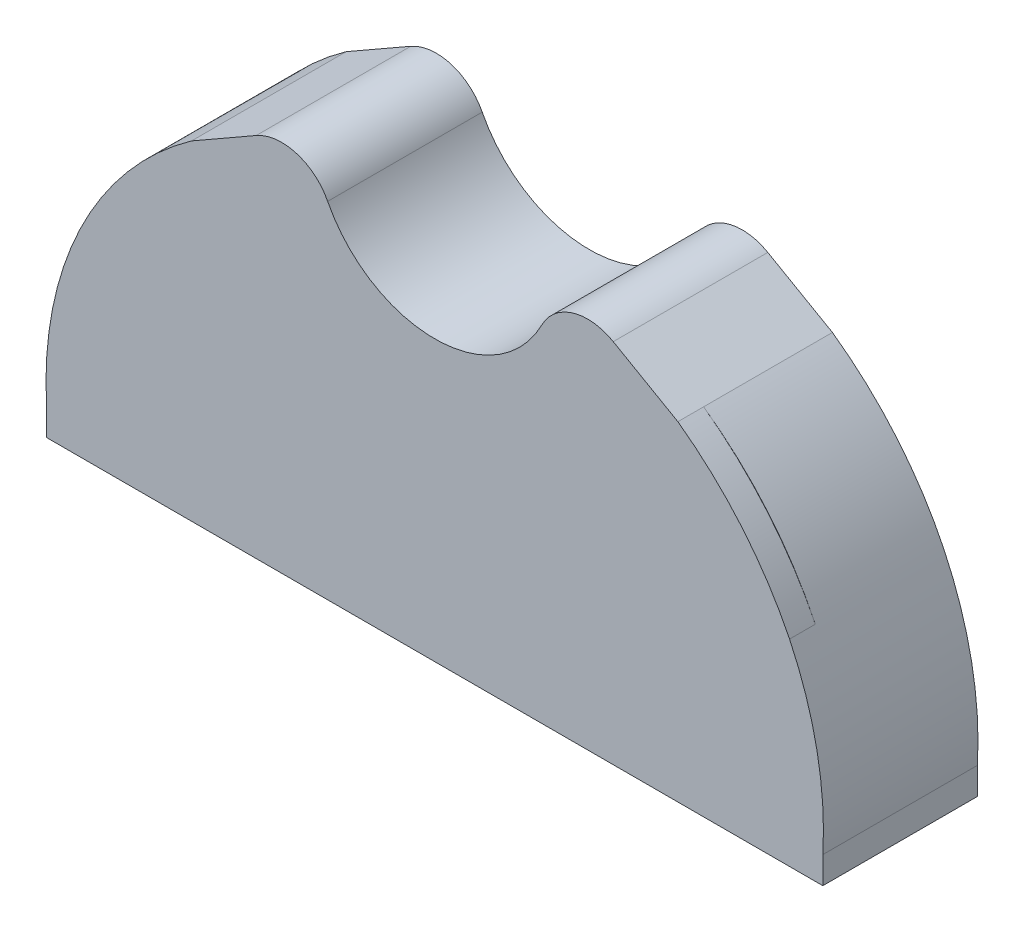
ISO-10303-21;
HEADER;
FILE_DESCRIPTION(('STEP AP214'),'2;1');
FILE_NAME('part.step','',(''),(''),'','','');
FILE_SCHEMA(('AUTOMOTIVE_DESIGN { 1 0 10303 214 1 1 1 1 }'));
ENDSEC;
DATA;
#1=APPLICATION_CONTEXT('core data for automotive mechanical design processes');
#2=APPLICATION_PROTOCOL_DEFINITION('international standard','automotive_design',2000,#1);
#3=PRODUCT_CONTEXT('',#1,'mechanical');
#4=PRODUCT('Part','Part','',(#3));
#5=PRODUCT_RELATED_PRODUCT_CATEGORY('part','',(#4));
#6=PRODUCT_DEFINITION_FORMATION('','',#4);
#7=PRODUCT_DEFINITION_CONTEXT('part definition',#1,'design');
#8=PRODUCT_DEFINITION('design','',#6,#7);
#9=PRODUCT_DEFINITION_SHAPE('','',#8);
#10=(LENGTH_UNIT() NAMED_UNIT(*) SI_UNIT(.MILLI.,.METRE.));
#11=(NAMED_UNIT(*) PLANE_ANGLE_UNIT() SI_UNIT($,.RADIAN.));
#12=(NAMED_UNIT(*) SI_UNIT($,.STERADIAN.) SOLID_ANGLE_UNIT());
#13=UNCERTAINTY_MEASURE_WITH_UNIT(LENGTH_MEASURE(1.E-05),#10,'distance_accuracy_value','');
#14=(GEOMETRIC_REPRESENTATION_CONTEXT(3) GLOBAL_UNCERTAINTY_ASSIGNED_CONTEXT((#13)) GLOBAL_UNIT_ASSIGNED_CONTEXT((#10,
#11,#12)) REPRESENTATION_CONTEXT('',''));
#15=CARTESIAN_POINT('',(0.,0.,0.));
#16=DIRECTION('',(0.,0.,1.));
#17=DIRECTION('',(1.,0.,0.));
#18=AXIS2_PLACEMENT_3D('',#15,#16,#17);
#19=CARTESIAN_POINT('',(27.7778489097587,5.09973857836434,-2.83493096218086));
#20=DIRECTION('',(0.,0.,-1.));
#21=DIRECTION('',(-1.,0.,0.));
#22=AXIS2_PLACEMENT_3D('',#19,#20,#21);
#23=PLANE('',#22);
#24=DIRECTION('',(-0.867919032677829,-0.496705700305101,0.));
#25=VECTOR('',#24,1.);
#26=CARTESIAN_POINT('',(-3.35591314571966,5.86395704618391,-2.83493096218086));
#27=LINE('',#26,#25);
#28=CARTESIAN_POINT('',(12.5796842966775,14.9838193713418,-2.83493096218086));
#29=VERTEX_POINT('',#28);
#30=CARTESIAN_POINT('',(10.6982631754413,13.9070915195408,-2.83493096218086));
#31=VERTEX_POINT('',#30);
#32=EDGE_CURVE('E258',#29,#31,#27,.T.);
#33=ORIENTED_EDGE('',*,*,#32,.F.);
#34=CARTESIAN_POINT('',(13.3247428471351,13.6819408223251,-2.83493096218086));
#35=DIRECTION('',(0.,0.,-1.));
#36=DIRECTION('',(-1.,0.,0.));
#37=AXIS2_PLACEMENT_3D('',#34,#35,#36);
#38=CIRCLE('',#37,1.5);
#39=CARTESIAN_POINT('',(14.6606746659222,14.3640597089954,-2.83493096218086));
#40=VERTEX_POINT('',#39);
#41=EDGE_CURVE('E47',#29,#40,#38,.T.);
#42=ORIENTED_EDGE('',*,*,#41,.T.);
#43=CARTESIAN_POINT('',(17.7778489097587,15.9556704445593,-2.83493096218086));
#44=DIRECTION('',(0.,0.,-1.));
#45=DIRECTION('',(-1.,0.,0.));
#46=AXIS2_PLACEMENT_3D('',#43,#44,#45);
#47=CIRCLE('',#46,3.5);
#48=CARTESIAN_POINT('',(20.8950231535951,14.3640597089954,-2.83493096218086));
#49=VERTEX_POINT('',#48);
#50=EDGE_CURVE('E257',#40,#49,#47,.F.);
#51=ORIENTED_EDGE('',*,*,#50,.T.);
#52=CARTESIAN_POINT('',(22.2309549723822,13.6819408223251,-2.83493096218086));
#53=DIRECTION('',(0.,0.,-1.));
#54=DIRECTION('',(-1.,0.,0.));
#55=AXIS2_PLACEMENT_3D('',#52,#53,#54);
#56=CIRCLE('',#55,1.5);
#57=CARTESIAN_POINT('',(22.9760135228399,14.9838193713418,-2.83493096218086));
#58=VERTEX_POINT('',#57);
#59=EDGE_CURVE('E62',#49,#58,#56,.T.);
#60=ORIENTED_EDGE('',*,*,#59,.T.);
#61=DIRECTION('',(0.86791903267783,-0.4967057003051,0.));
#62=VECTOR('',#61,1.);
#63=CARTESIAN_POINT('',(12.1280923411478,21.1920301427802,-2.83493096218086));
#64=LINE('',#63,#62);
#65=CARTESIAN_POINT('',(24.8574346440761,13.9070915195408,-2.83493096218086));
#66=VERTEX_POINT('',#65);
#67=EDGE_CURVE('E263',#58,#66,#64,.T.);
#68=ORIENTED_EDGE('',*,*,#67,.T.);
#69=CARTESIAN_POINT('',(19.046245228159,5.70754411908348,-2.83493096218086));
#70=DIRECTION('',(0.,0.,-1.));
#71=DIRECTION('',(-1.,0.,0.));
#72=AXIS2_PLACEMENT_3D('',#69,#70,#71);
#73=CIRCLE('',#72,10.0500000000006);
#74=CARTESIAN_POINT('',(29.0778489097587,5.09973857836434,-2.83493096218086));
#75=VERTEX_POINT('',#74);
#76=EDGE_CURVE('E266',#75,#66,#73,.F.);
#77=ORIENTED_EDGE('',*,*,#76,.F.);
#78=DIRECTION('',(0.,1.,0.));
#79=VECTOR('',#78,1.);
#80=CARTESIAN_POINT('',(29.0778489097587,0.,-2.83493096218086));
#81=LINE('',#80,#79);
#82=CARTESIAN_POINT('',(29.0778489097587,4.31545347676928,-2.83493096218086));
#83=VERTEX_POINT('',#82);
#84=EDGE_CURVE('E187',#83,#75,#81,.T.);
#85=ORIENTED_EDGE('',*,*,#84,.F.);
#86=DIRECTION('',(1.,0.,0.));
#87=VECTOR('',#86,1.);
#88=CARTESIAN_POINT('',(0.,4.31545347676928,-2.83493096218086));
#89=LINE('',#88,#87);
#90=CARTESIAN_POINT('',(27.8278489097587,4.31545347676928,-2.83493096218086));
#91=VERTEX_POINT('',#90);
#92=EDGE_CURVE('E184',#91,#83,#89,.T.);
#93=ORIENTED_EDGE('',*,*,#92,.F.);
#94=DIRECTION('',(0.,-1.,0.));
#95=VECTOR('',#94,1.);
#96=CARTESIAN_POINT('',(27.8278489097587,0.,-2.83493096218086));
#97=LINE('',#96,#95);
#98=CARTESIAN_POINT('',(27.8278489097587,5.09973857836434,-2.83493096218086));
#99=VERTEX_POINT('',#98);
#100=EDGE_CURVE('E273',#99,#91,#97,.T.);
#101=ORIENTED_EDGE('',*,*,#100,.F.);
#102=CARTESIAN_POINT('',(17.7778489097581,5.09973857836405,-2.83493096218086));
#103=DIRECTION('',(0.,0.,-1.));
#104=DIRECTION('',(-1.,0.,0.));
#105=AXIS2_PLACEMENT_3D('',#102,#103,#104);
#106=CIRCLE('',#105,10.0500000000006);
#107=CARTESIAN_POINT('',(24.0742946292179,12.9328268136585,-2.83493096218086));
#108=VERTEX_POINT('',#107);
#109=EDGE_CURVE('E277',#108,#99,#106,.T.);
#110=ORIENTED_EDGE('',*,*,#109,.F.);
#111=CARTESIAN_POINT('',(22.7899450048506,11.3350326960114,-2.83493096218086));
#112=DIRECTION('',(0.,0.,-1.));
#113=DIRECTION('',(-1.,0.,0.));
#114=AXIS2_PLACEMENT_3D('',#111,#112,#113);
#115=CIRCLE('',#114,2.05);
#116=CARTESIAN_POINT('',(20.92180009668,12.1791503430702,-2.83493096218086));
#117=VERTEX_POINT('',#116);
#118=EDGE_CURVE('E281',#117,#108,#115,.T.);
#119=ORIENTED_EDGE('',*,*,#118,.F.);
#120=CARTESIAN_POINT('',(17.7778489097587,13.5997385783643,-2.83493096218086));
#121=DIRECTION('',(0.,0.,-1.));
#122=DIRECTION('',(-1.,0.,0.));
#123=AXIS2_PLACEMENT_3D('',#120,#121,#122);
#124=CIRCLE('',#123,3.45);
#125=CARTESIAN_POINT('',(14.6338977228374,12.1791503430702,-2.83493096218086));
#126=VERTEX_POINT('',#125);
#127=EDGE_CURVE('E285',#126,#117,#124,.F.);
#128=ORIENTED_EDGE('',*,*,#127,.F.);
#129=CARTESIAN_POINT('',(12.7657528146667,11.3350326960114,-2.83493096218086));
#130=DIRECTION('',(0.,0.,-1.));
#131=DIRECTION('',(-1.,0.,0.));
#132=AXIS2_PLACEMENT_3D('',#129,#130,#131);
#133=CIRCLE('',#132,2.05);
#134=CARTESIAN_POINT('',(11.4814031902994,12.9328268136585,-2.83493096218086));
#135=VERTEX_POINT('',#134);
#136=EDGE_CURVE('E289',#135,#126,#133,.T.);
#137=ORIENTED_EDGE('',*,*,#136,.F.);
#138=CARTESIAN_POINT('',(17.7778489097587,5.09973857836434,-2.83493096218086));
#139=DIRECTION('',(0.,0.,-1.));
#140=DIRECTION('',(-1.,0.,0.));
#141=AXIS2_PLACEMENT_3D('',#138,#139,#140);
#142=CIRCLE('',#141,10.05);
#143=CARTESIAN_POINT('',(7.72784890975867,5.09973857836434,-2.83493096218086));
#144=VERTEX_POINT('',#143);
#145=EDGE_CURVE('E293',#144,#135,#142,.T.);
#146=ORIENTED_EDGE('',*,*,#145,.F.);
#147=DIRECTION('',(0.,-1.,0.));
#148=VECTOR('',#147,1.);
#149=CARTESIAN_POINT('',(7.72784890975867,0.,-2.83493096218086));
#150=LINE('',#149,#148);
#151=CARTESIAN_POINT('',(7.72784890975867,4.31545347676928,-2.83493096218086));
#152=VERTEX_POINT('',#151);
#153=EDGE_CURVE('E265',#144,#152,#150,.T.);
#154=ORIENTED_EDGE('',*,*,#153,.T.);
#155=DIRECTION('',(-1.,0.,0.));
#156=VECTOR('',#155,1.);
#157=CARTESIAN_POINT('',(0.,4.31545347676928,-2.83493096218086));
#158=LINE('',#157,#156);
#159=CARTESIAN_POINT('',(6.47784890975867,4.31545347676928,-2.83493096218086));
#160=VERTEX_POINT('',#159);
#161=EDGE_CURVE('E298',#152,#160,#158,.T.);
#162=ORIENTED_EDGE('',*,*,#161,.T.);
#163=DIRECTION('',(0.,1.,0.));
#164=VECTOR('',#163,1.);
#165=CARTESIAN_POINT('',(6.47784890975867,0.,-2.83493096218086));
#166=LINE('',#165,#164);
#167=CARTESIAN_POINT('',(6.47784890975867,5.09973857836434,-2.83493096218086));
#168=VERTEX_POINT('',#167);
#169=EDGE_CURVE('E261',#160,#168,#166,.T.);
#170=ORIENTED_EDGE('',*,*,#169,.T.);
#171=CARTESIAN_POINT('',(16.5094525913577,5.7075441190838,-2.83493096218086));
#172=DIRECTION('',(0.,0.,-1.));
#173=DIRECTION('',(-1.,0.,0.));
#174=AXIS2_PLACEMENT_3D('',#171,#172,#173);
#175=CIRCLE('',#174,10.05);
#176=EDGE_CURVE('E301',#31,#168,#175,.F.);
#177=ORIENTED_EDGE('',*,*,#176,.F.);
#178=EDGE_LOOP('',(#33,#42,#51,#60,#68,#77,#85,#93,#101,#110,#119,#128,#137,#146,#154,#162,#170,#177));
#179=FACE_BOUND('',#178,.T.);
#180=ADVANCED_FACE('F39',(#179),#23,.T.);
#181=CARTESIAN_POINT('',(-3.35591314571966,5.86395704618391,-28.2891846722938));
#182=DIRECTION('',(-0.496705700305101,0.867919032677829,0.));
#183=DIRECTION('',(-0.867919032677829,-0.496705700305101,0.));
#184=AXIS2_PLACEMENT_3D('',#181,#182,#183);
#185=PLANE('',#184);
#186=DIRECTION('',(0.,0.,1.));
#187=VECTOR('',#186,1.);
#188=CARTESIAN_POINT('',(10.6982631754413,13.9070915195408,-28.2891846722938));
#189=LINE('',#188,#187);
#190=CARTESIAN_POINT('',(10.6982631754413,13.9070915195408,1.66506903781914));
#191=VERTEX_POINT('',#190);
#192=EDGE_CURVE('E260',#31,#191,#189,.T.);
#193=ORIENTED_EDGE('',*,*,#192,.T.);
#194=DIRECTION('',(-0.867919032677829,-0.496705700305101,0.));
#195=VECTOR('',#194,1.);
#196=CARTESIAN_POINT('',(-3.35591314571965,5.86395704618391,1.66506903781914));
#197=LINE('',#196,#195);
#198=CARTESIAN_POINT('',(12.5796842966775,14.9838193713418,1.66506903781914));
#199=VERTEX_POINT('',#198);
#200=EDGE_CURVE('E223',#199,#191,#197,.T.);
#201=ORIENTED_EDGE('',*,*,#200,.F.);
#202=DIRECTION('',(0.,0.,-1.));
#203=VECTOR('',#202,1.);
#204=CARTESIAN_POINT('',(12.5796842966775,14.9838193713418,-2.83493096218086));
#205=LINE('',#204,#203);
#206=EDGE_CURVE('E333',#199,#29,#205,.T.);
#207=ORIENTED_EDGE('',*,*,#206,.T.);
#208=ORIENTED_EDGE('',*,*,#32,.T.);
#209=EDGE_LOOP('',(#193,#201,#207,#208));
#210=FACE_BOUND('',#209,.T.);
#211=ADVANCED_FACE('F349',(#210),#185,.T.);
#212=CARTESIAN_POINT('',(16.5094525913577,5.7075441190838,-28.2891846722938));
#213=DIRECTION('',(0.,0.,1.));
#214=DIRECTION('',(1.,0.,0.));
#215=AXIS2_PLACEMENT_3D('',#212,#213,#214);
#216=CYLINDRICAL_SURFACE('',#215,10.05);
#217=ORIENTED_EDGE('',*,*,#192,.F.);
#218=ORIENTED_EDGE('',*,*,#176,.T.);
#219=DIRECTION('',(0.,0.,1.));
#220=VECTOR('',#219,1.);
#221=CARTESIAN_POINT('',(6.47784890975867,5.09973857836434,-28.2891846722938));
#222=LINE('',#221,#220);
#223=CARTESIAN_POINT('',(6.47784890975867,5.09973857836434,1.66506903781914));
#224=VERTEX_POINT('',#223);
#225=EDGE_CURVE('E304',#168,#224,#222,.T.);
#226=ORIENTED_EDGE('',*,*,#225,.T.);
#227=CARTESIAN_POINT('',(16.5094525913577,5.7075441190838,1.66506903781914));
#228=DIRECTION('',(0.,0.,1.));
#229=DIRECTION('',(1.,0.,0.));
#230=AXIS2_PLACEMENT_3D('',#227,#228,#229);
#231=CIRCLE('',#230,10.05);
#232=EDGE_CURVE('E226',#191,#224,#231,.T.);
#233=ORIENTED_EDGE('',*,*,#232,.F.);
#234=EDGE_LOOP('',(#217,#218,#226,#233));
#235=FACE_BOUND('',#234,.T.);
#236=ADVANCED_FACE('F352',(#235),#216,.T.);
#237=CARTESIAN_POINT('',(6.47784890975867,0.,-28.2891846722938));
#238=DIRECTION('',(1.,0.,0.));
#239=DIRECTION('',(0.,0.,-1.));
#240=AXIS2_PLACEMENT_3D('',#237,#238,#239);
#241=PLANE('',#240);
#242=ORIENTED_EDGE('',*,*,#169,.F.);
#243=DIRECTION('',(0.,0.,1.));
#244=VECTOR('',#243,1.);
#245=CARTESIAN_POINT('',(6.47784890975867,4.31545347676928,-28.2891846722938));
#246=LINE('',#245,#244);
#247=CARTESIAN_POINT('',(6.47784890975867,4.31545347676928,1.66506903781914));
#248=VERTEX_POINT('',#247);
#249=EDGE_CURVE('E326',#160,#248,#246,.T.);
#250=ORIENTED_EDGE('',*,*,#249,.T.);
#251=DIRECTION('',(0.,-1.,0.));
#252=VECTOR('',#251,1.);
#253=CARTESIAN_POINT('',(6.47784890975867,0.,1.66506903781914));
#254=LINE('',#253,#252);
#255=EDGE_CURVE('E202',#224,#248,#254,.T.);
#256=ORIENTED_EDGE('',*,*,#255,.F.);
#257=ORIENTED_EDGE('',*,*,#225,.F.);
#258=EDGE_LOOP('',(#242,#250,#256,#257));
#259=FACE_BOUND('',#258,.T.);
#260=ADVANCED_FACE('F356',(#259),#241,.F.);
#261=CARTESIAN_POINT('',(0.,4.31545347676928,-28.2891846722938));
#262=DIRECTION('',(0.,1.,0.));
#263=DIRECTION('',(0.,0.,1.));
#264=AXIS2_PLACEMENT_3D('',#261,#262,#263);
#265=PLANE('',#264);
#266=ORIENTED_EDGE('',*,*,#161,.F.);
#267=DIRECTION('',(0.,0.,1.));
#268=VECTOR('',#267,1.);
#269=CARTESIAN_POINT('',(7.72784890975867,4.31545347676928,-28.2891846722938));
#270=LINE('',#269,#268);
#271=CARTESIAN_POINT('',(7.72784890975867,4.31545347676928,0.915069037819143));
#272=VERTEX_POINT('',#271);
#273=EDGE_CURVE('E323',#152,#272,#270,.T.);
#274=ORIENTED_EDGE('',*,*,#273,.T.);
#275=DIRECTION('',(1.,0.,0.));
#276=VECTOR('',#275,1.);
#277=CARTESIAN_POINT('',(0.,4.31545347676928,0.915069037819143));
#278=LINE('',#277,#276);
#279=CARTESIAN_POINT('',(27.8278489097587,4.31545347676928,0.915069037819143));
#280=VERTEX_POINT('',#279);
#281=EDGE_CURVE('E205',#272,#280,#278,.T.);
#282=ORIENTED_EDGE('',*,*,#281,.T.);
#283=DIRECTION('',(0.,0.,1.));
#284=VECTOR('',#283,1.);
#285=CARTESIAN_POINT('',(27.8278489097587,4.31545347676928,-28.2891846722938));
#286=LINE('',#285,#284);
#287=EDGE_CURVE('E272',#91,#280,#286,.T.);
#288=ORIENTED_EDGE('',*,*,#287,.F.);
#289=ORIENTED_EDGE('',*,*,#92,.T.);
#290=DIRECTION('',(0.,0.,1.));
#291=VECTOR('',#290,1.);
#292=CARTESIAN_POINT('',(29.0778489097587,4.31545347676928,-28.2891846722938));
#293=LINE('',#292,#291);
#294=CARTESIAN_POINT('',(29.0778489097587,4.31545347676928,1.66506903781914));
#295=VERTEX_POINT('',#294);
#296=EDGE_CURVE('E176',#83,#295,#293,.T.);
#297=ORIENTED_EDGE('',*,*,#296,.T.);
#298=DIRECTION('',(1.,0.,0.));
#299=VECTOR('',#298,1.);
#300=CARTESIAN_POINT('',(0.,4.31545347676928,1.66506903781914));
#301=LINE('',#300,#299);
#302=EDGE_CURVE('E182',#248,#295,#301,.T.);
#303=ORIENTED_EDGE('',*,*,#302,.F.);
#304=ORIENTED_EDGE('',*,*,#249,.F.);
#305=EDGE_LOOP('',(#266,#274,#282,#288,#289,#297,#303,#304));
#306=FACE_BOUND('',#305,.T.);
#307=ADVANCED_FACE('F179',(#306),#265,.F.);
#308=CARTESIAN_POINT('',(7.72784890975867,0.,-28.2891846722938));
#309=DIRECTION('',(-1.,0.,0.));
#310=DIRECTION('',(0.,0.,1.));
#311=AXIS2_PLACEMENT_3D('',#308,#309,#310);
#312=PLANE('',#311);
#313=ORIENTED_EDGE('',*,*,#153,.F.);
#314=DIRECTION('',(0.,0.,1.));
#315=VECTOR('',#314,1.);
#316=CARTESIAN_POINT('',(7.72784890975867,5.09973857836434,-28.2891846722938));
#317=LINE('',#316,#315);
#318=CARTESIAN_POINT('',(7.72784890975867,5.09973857836434,0.915069037819143));
#319=VERTEX_POINT('',#318);
#320=EDGE_CURVE('E296',#144,#319,#317,.T.);
#321=ORIENTED_EDGE('',*,*,#320,.T.);
#322=DIRECTION('',(0.,1.,0.));
#323=VECTOR('',#322,1.);
#324=CARTESIAN_POINT('',(7.72784890975867,0.,0.915069037819145));
#325=LINE('',#324,#323);
#326=EDGE_CURVE('E255',#272,#319,#325,.T.);
#327=ORIENTED_EDGE('',*,*,#326,.F.);
#328=ORIENTED_EDGE('',*,*,#273,.F.);
#329=EDGE_LOOP('',(#313,#321,#327,#328));
#330=FACE_BOUND('',#329,.T.);
#331=ADVANCED_FACE('F362',(#330),#312,.F.);
#332=CARTESIAN_POINT('',(17.7778489097587,5.09973857836434,-28.2891846722938));
#333=DIRECTION('',(0.,0.,1.));
#334=DIRECTION('',(1.,0.,0.));
#335=AXIS2_PLACEMENT_3D('',#332,#333,#334);
#336=CYLINDRICAL_SURFACE('',#335,10.05);
#337=ORIENTED_EDGE('',*,*,#320,.F.);
#338=ORIENTED_EDGE('',*,*,#145,.T.);
#339=DIRECTION('',(0.,0.,1.));
#340=VECTOR('',#339,1.);
#341=CARTESIAN_POINT('',(11.4814031902994,12.9328268136585,-28.2891846722938));
#342=LINE('',#341,#340);
#343=CARTESIAN_POINT('',(11.4814031902994,12.9328268136585,0.915069037819145));
#344=VERTEX_POINT('',#343);
#345=EDGE_CURVE('E292',#135,#344,#342,.T.);
#346=ORIENTED_EDGE('',*,*,#345,.T.);
#347=CARTESIAN_POINT('',(17.7778489097587,5.09973857836434,0.915069037819141));
#348=DIRECTION('',(0.,0.,-1.));
#349=DIRECTION('',(-1.,0.,0.));
#350=AXIS2_PLACEMENT_3D('',#347,#348,#349);
#351=CIRCLE('',#350,10.05);
#352=EDGE_CURVE('E252',#344,#319,#351,.F.);
#353=ORIENTED_EDGE('',*,*,#352,.T.);
#354=EDGE_LOOP('',(#337,#338,#346,#353));
#355=FACE_BOUND('',#354,.T.);
#356=ADVANCED_FACE('F402',(#355),#336,.F.);
#357=CARTESIAN_POINT('',(12.7657528146667,11.3350326960114,-28.2891846722938));
#358=DIRECTION('',(0.,0.,1.));
#359=DIRECTION('',(1.,0.,0.));
#360=AXIS2_PLACEMENT_3D('',#357,#358,#359);
#361=CYLINDRICAL_SURFACE('',#360,2.05);
#362=ORIENTED_EDGE('',*,*,#345,.F.);
#363=ORIENTED_EDGE('',*,*,#136,.T.);
#364=DIRECTION('',(0.,0.,1.));
#365=VECTOR('',#364,1.);
#366=CARTESIAN_POINT('',(14.6338977228374,12.1791503430702,-28.2891846722938));
#367=LINE('',#366,#365);
#368=CARTESIAN_POINT('',(14.6338977228374,12.1791503430702,0.915069037819142));
#369=VERTEX_POINT('',#368);
#370=EDGE_CURVE('E288',#126,#369,#367,.T.);
#371=ORIENTED_EDGE('',*,*,#370,.T.);
#372=CARTESIAN_POINT('',(12.7657528146667,11.3350326960114,0.915069037819145));
#373=DIRECTION('',(0.,0.,-1.));
#374=DIRECTION('',(-1.,0.,0.));
#375=AXIS2_PLACEMENT_3D('',#372,#373,#374);
#376=CIRCLE('',#375,2.05);
#377=EDGE_CURVE('E249',#369,#344,#376,.F.);
#378=ORIENTED_EDGE('',*,*,#377,.T.);
#379=EDGE_LOOP('',(#362,#363,#371,#378));
#380=FACE_BOUND('',#379,.T.);
#381=ADVANCED_FACE('F405',(#380),#361,.F.);
#382=CARTESIAN_POINT('',(17.7778489097587,13.5997385783643,-28.2891846722938));
#383=DIRECTION('',(0.,0.,1.));
#384=DIRECTION('',(1.,0.,0.));
#385=AXIS2_PLACEMENT_3D('',#382,#383,#384);
#386=CYLINDRICAL_SURFACE('',#385,3.45);
#387=ORIENTED_EDGE('',*,*,#370,.F.);
#388=ORIENTED_EDGE('',*,*,#127,.T.);
#389=DIRECTION('',(0.,0.,1.));
#390=VECTOR('',#389,1.);
#391=CARTESIAN_POINT('',(20.92180009668,12.1791503430702,-28.2891846722938));
#392=LINE('',#391,#390);
#393=CARTESIAN_POINT('',(20.92180009668,12.1791503430702,0.915069037819141));
#394=VERTEX_POINT('',#393);
#395=EDGE_CURVE('E284',#117,#394,#392,.T.);
#396=ORIENTED_EDGE('',*,*,#395,.T.);
#397=CARTESIAN_POINT('',(17.7778489097587,13.5997385783643,0.915069037819141));
#398=DIRECTION('',(0.,0.,-1.));
#399=DIRECTION('',(-1.,0.,0.));
#400=AXIS2_PLACEMENT_3D('',#397,#398,#399);
#401=CIRCLE('',#400,3.45);
#402=EDGE_CURVE('E246',#394,#369,#401,.T.);
#403=ORIENTED_EDGE('',*,*,#402,.T.);
#404=EDGE_LOOP('',(#387,#388,#396,#403));
#405=FACE_BOUND('',#404,.T.);
#406=ADVANCED_FACE('F409',(#405),#386,.T.);
#407=CARTESIAN_POINT('',(22.7899450048506,11.3350326960114,-28.2891846722938));
#408=DIRECTION('',(0.,0.,1.));
#409=DIRECTION('',(1.,0.,0.));
#410=AXIS2_PLACEMENT_3D('',#407,#408,#409);
#411=CYLINDRICAL_SURFACE('',#410,2.05);
#412=ORIENTED_EDGE('',*,*,#395,.F.);
#413=ORIENTED_EDGE('',*,*,#118,.T.);
#414=DIRECTION('',(0.,0.,1.));
#415=VECTOR('',#414,1.);
#416=CARTESIAN_POINT('',(24.0742946292179,12.9328268136585,-28.2891846722938));
#417=LINE('',#416,#415);
#418=CARTESIAN_POINT('',(24.0742946292179,12.9328268136585,0.91506903781914));
#419=VERTEX_POINT('',#418);
#420=EDGE_CURVE('E280',#108,#419,#417,.T.);
#421=ORIENTED_EDGE('',*,*,#420,.T.);
#422=CARTESIAN_POINT('',(22.7899450048506,11.3350326960114,0.915069037819141));
#423=DIRECTION('',(0.,0.,-1.));
#424=DIRECTION('',(-1.,0.,0.));
#425=AXIS2_PLACEMENT_3D('',#422,#423,#424);
#426=CIRCLE('',#425,2.05);
#427=EDGE_CURVE('E243',#419,#394,#426,.F.);
#428=ORIENTED_EDGE('',*,*,#427,.T.);
#429=EDGE_LOOP('',(#412,#413,#421,#428));
#430=FACE_BOUND('',#429,.T.);
#431=ADVANCED_FACE('F413',(#430),#411,.F.);
#432=CARTESIAN_POINT('',(17.7778489097581,5.09973857836405,-28.2891846722938));
#433=DIRECTION('',(0.,0.,1.));
#434=DIRECTION('',(1.,0.,0.));
#435=AXIS2_PLACEMENT_3D('',#432,#433,#434);
#436=CYLINDRICAL_SURFACE('',#435,10.0500000000006);
#437=ORIENTED_EDGE('',*,*,#420,.F.);
#438=ORIENTED_EDGE('',*,*,#109,.T.);
#439=DIRECTION('',(0.,0.,1.));
#440=VECTOR('',#439,1.);
#441=CARTESIAN_POINT('',(27.8278489097587,5.09973857836434,-28.2891846722938));
#442=LINE('',#441,#440);
#443=CARTESIAN_POINT('',(27.8278489097587,5.09973857836434,0.915069037819141));
#444=VERTEX_POINT('',#443);
#445=EDGE_CURVE('E276',#99,#444,#442,.T.);
#446=ORIENTED_EDGE('',*,*,#445,.T.);
#447=CARTESIAN_POINT('',(17.7778489097581,5.09973857836405,0.915069037819141));
#448=DIRECTION('',(0.,0.,-1.));
#449=DIRECTION('',(-1.,0.,0.));
#450=AXIS2_PLACEMENT_3D('',#447,#448,#449);
#451=CIRCLE('',#450,10.0500000000006);
#452=EDGE_CURVE('E240',#444,#419,#451,.F.);
#453=ORIENTED_EDGE('',*,*,#452,.T.);
#454=EDGE_LOOP('',(#437,#438,#446,#453));
#455=FACE_BOUND('',#454,.T.);
#456=ADVANCED_FACE('F417',(#455),#436,.F.);
#457=CARTESIAN_POINT('',(27.8278489097587,0.,-28.2891846722938));
#458=DIRECTION('',(-1.,0.,0.));
#459=DIRECTION('',(0.,0.,1.));
#460=AXIS2_PLACEMENT_3D('',#457,#458,#459);
#461=PLANE('',#460);
#462=ORIENTED_EDGE('',*,*,#445,.F.);
#463=ORIENTED_EDGE('',*,*,#100,.T.);
#464=ORIENTED_EDGE('',*,*,#287,.T.);
#465=DIRECTION('',(0.,1.,0.));
#466=VECTOR('',#465,1.);
#467=CARTESIAN_POINT('',(27.8278489097587,0.,0.915069037819141));
#468=LINE('',#467,#466);
#469=EDGE_CURVE('E237',#280,#444,#468,.T.);
#470=ORIENTED_EDGE('',*,*,#469,.T.);
#471=EDGE_LOOP('',(#462,#463,#464,#470));
#472=FACE_BOUND('',#471,.T.);
#473=ADVANCED_FACE('F367',(#472),#461,.T.);
#474=CARTESIAN_POINT('',(29.0778489097587,0.,-28.2891846722938));
#475=DIRECTION('',(1.,0.,0.));
#476=DIRECTION('',(0.,0.,-1.));
#477=AXIS2_PLACEMENT_3D('',#474,#475,#476);
#478=PLANE('',#477);
#479=ORIENTED_EDGE('',*,*,#296,.F.);
#480=ORIENTED_EDGE('',*,*,#84,.T.);
#481=DIRECTION('',(0.,0.,1.));
#482=VECTOR('',#481,1.);
#483=CARTESIAN_POINT('',(29.0778489097587,5.09973857836434,-28.2891846722938));
#484=LINE('',#483,#482);
#485=CARTESIAN_POINT('',(29.0778489097587,5.09973857836434,1.66506903781914));
#486=VERTEX_POINT('',#485);
#487=EDGE_CURVE('E193',#75,#486,#484,.T.);
#488=ORIENTED_EDGE('',*,*,#487,.T.);
#489=DIRECTION('',(0.,1.,0.));
#490=VECTOR('',#489,1.);
#491=CARTESIAN_POINT('',(29.0778489097587,0.,1.66506903781914));
#492=LINE('',#491,#490);
#493=EDGE_CURVE('E190',#295,#486,#492,.T.);
#494=ORIENTED_EDGE('',*,*,#493,.F.);
#495=EDGE_LOOP('',(#479,#480,#488,#494));
#496=FACE_BOUND('',#495,.T.);
#497=ADVANCED_FACE('F191',(#496),#478,.T.);
#498=CARTESIAN_POINT('',(19.046245228159,5.70754411908348,-28.2891846722938));
#499=DIRECTION('',(0.,0.,1.));
#500=DIRECTION('',(1.,0.,0.));
#501=AXIS2_PLACEMENT_3D('',#498,#499,#500);
#502=CYLINDRICAL_SURFACE('',#501,10.0500000000006);
#503=ORIENTED_EDGE('',*,*,#487,.F.);
#504=ORIENTED_EDGE('',*,*,#76,.T.);
#505=DIRECTION('',(0.,0.,1.));
#506=VECTOR('',#505,1.);
#507=CARTESIAN_POINT('',(24.8574346440761,13.9070915195408,-28.2891846722938));
#508=LINE('',#507,#506);
#509=CARTESIAN_POINT('',(24.8574346440761,13.9070915195408,0.915069037819143));
#510=VERTEX_POINT('',#509);
#511=EDGE_CURVE('E269',#66,#510,#508,.T.);
#512=ORIENTED_EDGE('',*,*,#511,.T.);
#513=CARTESIAN_POINT('',(19.046245228159,5.70754411908348,0.915069037819141));
#514=DIRECTION('',(0.,0.,-1.));
#515=DIRECTION('',(-1.,0.,0.));
#516=AXIS2_PLACEMENT_3D('',#513,#514,#515);
#517=CIRCLE('',#516,10.0500000000006);
#518=CARTESIAN_POINT('',(28.1094063621284,10.0505396589982,0.915069037819095));
#519=VERTEX_POINT('',#518);
#520=EDGE_CURVE('E234',#510,#519,#517,.T.);
#521=ORIENTED_EDGE('',*,*,#520,.T.);
#522=DIRECTION('',(0.,0.,-1.));
#523=VECTOR('',#522,1.);
#524=CARTESIAN_POINT('',(28.1094063621284,10.0505396589982,1.66506903781914));
#525=LINE('',#524,#523);
#526=CARTESIAN_POINT('',(28.1094063621284,10.0505396589982,1.66506903781914));
#527=VERTEX_POINT('',#526);
#528=EDGE_CURVE('E54',#527,#519,#525,.T.);
#529=ORIENTED_EDGE('',*,*,#528,.F.);
#530=CARTESIAN_POINT('',(19.046245228159,5.70754411908348,1.66506903781914));
#531=DIRECTION('',(0.,0.,1.));
#532=DIRECTION('',(1.,0.,0.));
#533=AXIS2_PLACEMENT_3D('',#530,#531,#532);
#534=CIRCLE('',#533,10.0500000000006);
#535=EDGE_CURVE('E196',#486,#527,#534,.T.);
#536=ORIENTED_EDGE('',*,*,#535,.F.);
#537=EDGE_LOOP('',(#503,#504,#512,#521,#529,#536));
#538=FACE_BOUND('',#537,.T.);
#539=ADVANCED_FACE('F371',(#538),#502,.T.);
#540=CARTESIAN_POINT('',(12.1280923411478,21.1920301427802,-28.2891846722938));
#541=DIRECTION('',(-0.4967057003051,-0.86791903267783,0.));
#542=DIRECTION('',(0.86791903267783,-0.4967057003051,0.));
#543=AXIS2_PLACEMENT_3D('',#540,#541,#542);
#544=PLANE('',#543);
#545=ORIENTED_EDGE('',*,*,#67,.F.);
#546=DIRECTION('',(0.,0.,1.));
#547=VECTOR('',#546,1.);
#548=CARTESIAN_POINT('',(22.9760135228399,14.9838193713418,-28.2891846722938));
#549=LINE('',#548,#547);
#550=CARTESIAN_POINT('',(22.9760135228399,14.9838193713418,1.66506903781914));
#551=VERTEX_POINT('',#550);
#552=EDGE_CURVE('E11',#58,#551,#549,.T.);
#553=ORIENTED_EDGE('',*,*,#552,.T.);
#554=DIRECTION('',(-0.86791903267783,0.4967057003051,0.));
#555=VECTOR('',#554,1.);
#556=CARTESIAN_POINT('',(12.1280923411478,21.1920301427802,1.66506903781914));
#557=LINE('',#556,#555);
#558=CARTESIAN_POINT('',(24.8574346440761,13.9070915195408,1.66506903781914));
#559=VERTEX_POINT('',#558);
#560=EDGE_CURVE('E211',#559,#551,#557,.T.);
#561=ORIENTED_EDGE('',*,*,#560,.F.);
#562=DIRECTION('',(0.,0.,-1.));
#563=VECTOR('',#562,1.);
#564=CARTESIAN_POINT('',(24.8574346440761,13.9070915195408,1.66506903781914));
#565=LINE('',#564,#563);
#566=EDGE_CURVE('E229',#559,#510,#565,.T.);
#567=ORIENTED_EDGE('',*,*,#566,.T.);
#568=ORIENTED_EDGE('',*,*,#511,.F.);
#569=EDGE_LOOP('',(#545,#553,#561,#567,#568));
#570=FACE_BOUND('',#569,.T.);
#571=ADVANCED_FACE('F377',(#570),#544,.F.);
#572=CARTESIAN_POINT('',(17.7778489097587,15.9556704445593,-28.2891846722938));
#573=DIRECTION('',(0.,0.,1.));
#574=DIRECTION('',(1.,0.,0.));
#575=AXIS2_PLACEMENT_3D('',#572,#573,#574);
#576=CYLINDRICAL_SURFACE('',#575,3.5);
#577=ORIENTED_EDGE('',*,*,#50,.F.);
#578=DIRECTION('',(0.,0.,1.));
#579=VECTOR('',#578,1.);
#580=CARTESIAN_POINT('',(14.6606746659222,14.3640597089954,-28.2891846722938));
#581=LINE('',#580,#579);
#582=CARTESIAN_POINT('',(14.6606746659222,14.3640597089954,1.66506903781914));
#583=VERTEX_POINT('',#582);
#584=EDGE_CURVE('E331',#40,#583,#581,.T.);
#585=ORIENTED_EDGE('',*,*,#584,.T.);
#586=CARTESIAN_POINT('',(17.7778489097587,15.9556704445593,1.66506903781914));
#587=DIRECTION('',(0.,0.,1.));
#588=DIRECTION('',(1.,0.,0.));
#589=AXIS2_PLACEMENT_3D('',#586,#587,#588);
#590=CIRCLE('',#589,3.5);
#591=CARTESIAN_POINT('',(20.8950231535951,14.3640597089954,1.66506903781914));
#592=VERTEX_POINT('',#591);
#593=EDGE_CURVE('E217',#592,#583,#590,.F.);
#594=ORIENTED_EDGE('',*,*,#593,.F.);
#595=DIRECTION('',(0.,0.,1.));
#596=VECTOR('',#595,1.);
#597=CARTESIAN_POINT('',(20.8950231535951,14.3640597089954,-28.2891846722938));
#598=LINE('',#597,#596);
#599=EDGE_CURVE('E307',#592,#49,#598,.F.);
#600=ORIENTED_EDGE('',*,*,#599,.T.);
#601=EDGE_LOOP('',(#577,#585,#594,#600));
#602=FACE_BOUND('',#601,.T.);
#603=ADVANCED_FACE('F342',(#602),#576,.F.);
#604=CARTESIAN_POINT('',(27.7778489097587,15.0997385783643,0.915069037819139));
#605=DIRECTION('',(0.,0.,-1.));
#606=DIRECTION('',(-1.,0.,0.));
#607=AXIS2_PLACEMENT_3D('',#604,#605,#606);
#608=PLANE('',#607);
#609=ORIENTED_EDGE('',*,*,#520,.F.);
#610=CARTESIAN_POINT('',(18.7505179363684,5.45817711354713,0.915069037819143));
#611=DIRECTION('',(0.,0.,1.));
#612=DIRECTION('',(1.,0.,0.));
#613=AXIS2_PLACEMENT_3D('',#610,#611,#612);
#614=CIRCLE('',#613,10.4249022208693);
#615=EDGE_CURVE('E203',#510,#519,#614,.F.);
#616=ORIENTED_EDGE('',*,*,#615,.T.);
#617=EDGE_LOOP('',(#609,#616));
#618=FACE_BOUND('',#617,.T.);
#619=ADVANCED_FACE('F386',(#618),#608,.F.);
#620=CARTESIAN_POINT('',(13.3247428471351,13.6819408223251,-28.2891846722938));
#621=DIRECTION('',(0.,0.,1.));
#622=DIRECTION('',(1.,0.,0.));
#623=AXIS2_PLACEMENT_3D('',#620,#621,#622);
#624=CYLINDRICAL_SURFACE('',#623,1.5);
#625=ORIENTED_EDGE('',*,*,#41,.F.);
#626=ORIENTED_EDGE('',*,*,#206,.F.);
#627=CARTESIAN_POINT('',(13.3247428471351,13.6819408223251,1.66506903781914));
#628=DIRECTION('',(0.,0.,1.));
#629=DIRECTION('',(1.,0.,0.));
#630=AXIS2_PLACEMENT_3D('',#627,#628,#629);
#631=CIRCLE('',#630,1.5);
#632=EDGE_CURVE('E220',#583,#199,#631,.T.);
#633=ORIENTED_EDGE('',*,*,#632,.F.);
#634=ORIENTED_EDGE('',*,*,#584,.F.);
#635=EDGE_LOOP('',(#625,#626,#633,#634));
#636=FACE_BOUND('',#635,.T.);
#637=ADVANCED_FACE('F345',(#636),#624,.T.);
#638=CARTESIAN_POINT('',(22.2309549723822,13.6819408223251,-28.2891846722938));
#639=DIRECTION('',(0.,0.,1.));
#640=DIRECTION('',(1.,0.,0.));
#641=AXIS2_PLACEMENT_3D('',#638,#639,#640);
#642=CYLINDRICAL_SURFACE('',#641,1.5);
#643=ORIENTED_EDGE('',*,*,#59,.F.);
#644=ORIENTED_EDGE('',*,*,#599,.F.);
#645=CARTESIAN_POINT('',(22.2309549723822,13.6819408223251,1.66506903781914));
#646=DIRECTION('',(0.,0.,1.));
#647=DIRECTION('',(1.,0.,0.));
#648=AXIS2_PLACEMENT_3D('',#645,#646,#647);
#649=CIRCLE('',#648,1.5);
#650=EDGE_CURVE('E214',#551,#592,#649,.T.);
#651=ORIENTED_EDGE('',*,*,#650,.F.);
#652=ORIENTED_EDGE('',*,*,#552,.F.);
#653=EDGE_LOOP('',(#643,#644,#651,#652));
#654=FACE_BOUND('',#653,.T.);
#655=ADVANCED_FACE('F41',(#654),#642,.T.);
#656=CARTESIAN_POINT('',(0.,0.,0.915069037819143));
#657=DIRECTION('',(0.,0.,1.));
#658=DIRECTION('',(1.,0.,0.));
#659=AXIS2_PLACEMENT_3D('',#656,#657,#658);
#660=PLANE('',#659);
#661=ORIENTED_EDGE('',*,*,#281,.F.);
#662=ORIENTED_EDGE('',*,*,#326,.T.);
#663=ORIENTED_EDGE('',*,*,#352,.F.);
#664=ORIENTED_EDGE('',*,*,#377,.F.);
#665=ORIENTED_EDGE('',*,*,#402,.F.);
#666=ORIENTED_EDGE('',*,*,#427,.F.);
#667=ORIENTED_EDGE('',*,*,#452,.F.);
#668=ORIENTED_EDGE('',*,*,#469,.F.);
#669=EDGE_LOOP('',(#661,#662,#663,#664,#665,#666,#667,#668));
#670=FACE_BOUND('',#669,.T.);
#671=ADVANCED_FACE('F364',(#670),#660,.F.);
#672=CARTESIAN_POINT('',(18.7505179363684,5.45817711354713,1.66506903781914));
#673=DIRECTION('',(0.,0.,-1.));
#674=DIRECTION('',(-1.,0.,0.));
#675=AXIS2_PLACEMENT_3D('',#672,#673,#674);
#676=CYLINDRICAL_SURFACE('',#675,10.4249022208693);
#677=ORIENTED_EDGE('',*,*,#615,.F.);
#678=ORIENTED_EDGE('',*,*,#566,.F.);
#679=CARTESIAN_POINT('',(18.7505179363684,5.45817711354713,1.66506903781914));
#680=DIRECTION('',(0.,0.,1.));
#681=DIRECTION('',(1.,0.,0.));
#682=AXIS2_PLACEMENT_3D('',#679,#680,#681);
#683=CIRCLE('',#682,10.4249022208693);
#684=EDGE_CURVE('E209',#559,#527,#683,.F.);
#685=ORIENTED_EDGE('',*,*,#684,.T.);
#686=ORIENTED_EDGE('',*,*,#528,.T.);
#687=EDGE_LOOP('',(#677,#678,#685,#686));
#688=FACE_BOUND('',#687,.T.);
#689=ADVANCED_FACE('F375',(#688),#676,.T.);
#690=CARTESIAN_POINT('',(0.,0.,1.66506903781914));
#691=DIRECTION('',(0.,0.,1.));
#692=DIRECTION('',(1.,0.,0.));
#693=AXIS2_PLACEMENT_3D('',#690,#691,#692);
#694=PLANE('',#693);
#695=ORIENTED_EDGE('',*,*,#302,.T.);
#696=ORIENTED_EDGE('',*,*,#493,.T.);
#697=ORIENTED_EDGE('',*,*,#535,.T.);
#698=ORIENTED_EDGE('',*,*,#684,.F.);
#699=ORIENTED_EDGE('',*,*,#560,.T.);
#700=ORIENTED_EDGE('',*,*,#650,.T.);
#701=ORIENTED_EDGE('',*,*,#593,.T.);
#702=ORIENTED_EDGE('',*,*,#632,.T.);
#703=ORIENTED_EDGE('',*,*,#200,.T.);
#704=ORIENTED_EDGE('',*,*,#232,.T.);
#705=ORIENTED_EDGE('',*,*,#255,.T.);
#706=EDGE_LOOP('',(#695,#696,#697,#698,#699,#700,#701,#702,#703,#704,#705));
#707=FACE_BOUND('',#706,.T.);
#708=ADVANCED_FACE('F199',(#707),#694,.T.);
#709=CLOSED_SHELL('',(#180,#211,#236,#260,#307,#331,#356,#381,#406,#431,#456,#473,#497,#539,
#571,#603,#619,#637,#655,#671,#689,#708));
#710=MANIFOLD_SOLID_BREP('B2',#709);
#711=ADVANCED_BREP_SHAPE_REPRESENTATION('',(#18,#710),#14);
#712=SHAPE_DEFINITION_REPRESENTATION(#9,#711);
ENDSEC;
END-ISO-10303-21;
